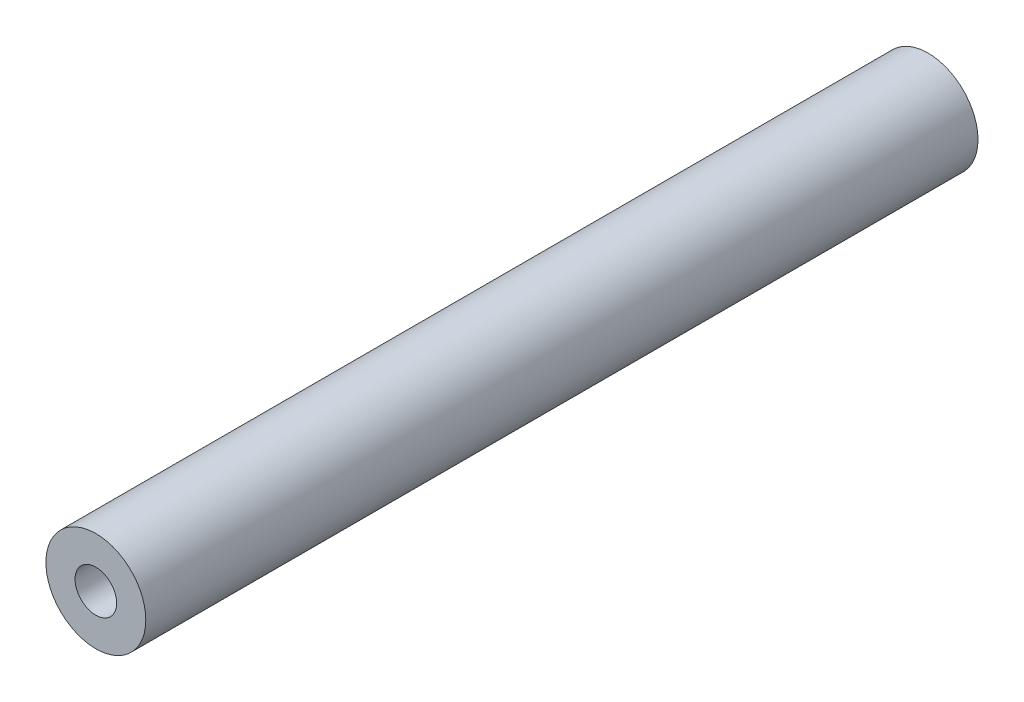
ISO-10303-21;
HEADER;
FILE_DESCRIPTION(('STEP AP214'),'2;1');
FILE_NAME('part.step','',(''),(''),'','','');
FILE_SCHEMA(('AUTOMOTIVE_DESIGN { 1 0 10303 214 1 1 1 1 }'));
ENDSEC;
DATA;
#1=APPLICATION_CONTEXT('core data for automotive mechanical design processes');
#2=APPLICATION_PROTOCOL_DEFINITION('international standard','automotive_design',2000,#1);
#3=PRODUCT_CONTEXT('',#1,'mechanical');
#4=PRODUCT('Part','Part','',(#3));
#5=PRODUCT_RELATED_PRODUCT_CATEGORY('part','',(#4));
#6=PRODUCT_DEFINITION_FORMATION('','',#4);
#7=PRODUCT_DEFINITION_CONTEXT('part definition',#1,'design');
#8=PRODUCT_DEFINITION('design','',#6,#7);
#9=PRODUCT_DEFINITION_SHAPE('','',#8);
#10=(LENGTH_UNIT() NAMED_UNIT(*) SI_UNIT(.MILLI.,.METRE.));
#11=(NAMED_UNIT(*) PLANE_ANGLE_UNIT() SI_UNIT($,.RADIAN.));
#12=(NAMED_UNIT(*) SI_UNIT($,.STERADIAN.) SOLID_ANGLE_UNIT());
#13=UNCERTAINTY_MEASURE_WITH_UNIT(LENGTH_MEASURE(1.E-05),#10,'distance_accuracy_value','');
#14=(GEOMETRIC_REPRESENTATION_CONTEXT(3) GLOBAL_UNCERTAINTY_ASSIGNED_CONTEXT((#13)) GLOBAL_UNIT_ASSIGNED_CONTEXT((#10,
#11,#12)) REPRESENTATION_CONTEXT('',''));
#15=CARTESIAN_POINT('',(0.,0.,0.));
#16=DIRECTION('',(0.,0.,1.));
#17=DIRECTION('',(1.,0.,0.));
#18=AXIS2_PLACEMENT_3D('',#15,#16,#17);
#19=CARTESIAN_POINT('',(0.,0.,100.));
#20=DIRECTION('',(0.,0.,-1.));
#21=DIRECTION('',(-1.,0.,0.));
#22=AXIS2_PLACEMENT_3D('',#19,#20,#21);
#23=CYLINDRICAL_SURFACE('',#22,6.);
#24=CARTESIAN_POINT('',(0.,0.,100.));
#25=DIRECTION('',(0.,0.,1.));
#26=DIRECTION('',(1.,0.,0.));
#27=AXIS2_PLACEMENT_3D('',#24,#25,#26);
#28=CIRCLE('',#27,6.);
#29=CARTESIAN_POINT('',(6.,0.,100.));
#30=VERTEX_POINT('',#29);
#31=EDGE_CURVE('E11',#30,#30,#28,.T.);
#32=ORIENTED_EDGE('',*,*,#31,.F.);
#33=EDGE_LOOP('',(#32));
#34=FACE_BOUND('',#33,.T.);
#35=CARTESIAN_POINT('',(0.,0.,0.));
#36=DIRECTION('',(0.,0.,1.));
#37=DIRECTION('',(1.,0.,0.));
#38=AXIS2_PLACEMENT_3D('',#35,#36,#37);
#39=CIRCLE('',#38,6.);
#40=CARTESIAN_POINT('',(6.,0.,0.));
#41=VERTEX_POINT('',#40);
#42=EDGE_CURVE('E42',#41,#41,#39,.T.);
#43=ORIENTED_EDGE('',*,*,#42,.T.);
#44=EDGE_LOOP('',(#43));
#45=FACE_BOUND('',#44,.T.);
#46=ADVANCED_FACE('F39',(#34,#45),#23,.T.);
#47=CARTESIAN_POINT('',(0.,0.,100.));
#48=DIRECTION('',(0.,0.,1.));
#49=DIRECTION('',(1.,0.,0.));
#50=AXIS2_PLACEMENT_3D('',#47,#48,#49);
#51=PLANE('',#50);
#52=CARTESIAN_POINT('',(0.,0.,100.));
#53=DIRECTION('',(0.,0.,1.));
#54=DIRECTION('',(1.,0.,0.));
#55=AXIS2_PLACEMENT_3D('',#52,#53,#54);
#56=CIRCLE('',#55,2.49999999999999);
#57=CARTESIAN_POINT('',(2.49999999999999,0.,100.));
#58=VERTEX_POINT('',#57);
#59=EDGE_CURVE('E63',#58,#58,#56,.T.);
#60=ORIENTED_EDGE('',*,*,#59,.F.);
#61=EDGE_LOOP('',(#60));
#62=FACE_BOUND('',#61,.T.);
#63=ORIENTED_EDGE('',*,*,#31,.T.);
#64=EDGE_LOOP('',(#63));
#65=FACE_BOUND('',#64,.T.);
#66=ADVANCED_FACE('F81',(#62,#65),#51,.T.);
#67=CARTESIAN_POINT('',(0.,0.,0.));
#68=DIRECTION('',(0.,0.,1.));
#69=DIRECTION('',(1.,0.,0.));
#70=AXIS2_PLACEMENT_3D('',#67,#68,#69);
#71=PLANE('',#70);
#72=CARTESIAN_POINT('',(0.,0.,0.));
#73=DIRECTION('',(0.,0.,-1.));
#74=DIRECTION('',(-1.,0.,0.));
#75=AXIS2_PLACEMENT_3D('',#72,#73,#74);
#76=CIRCLE('',#75,2.5);
#77=CARTESIAN_POINT('',(-2.5,0.,0.));
#78=VERTEX_POINT('',#77);
#79=EDGE_CURVE('E62',#78,#78,#76,.T.);
#80=ORIENTED_EDGE('',*,*,#79,.F.);
#81=EDGE_LOOP('',(#80));
#82=FACE_BOUND('',#81,.T.);
#83=ORIENTED_EDGE('',*,*,#42,.F.);
#84=EDGE_LOOP('',(#83));
#85=FACE_BOUND('',#84,.T.);
#86=ADVANCED_FACE('F78',(#82,#85),#71,.F.);
#87=CARTESIAN_POINT('',(0.,0.,15.));
#88=DIRECTION('',(0.,0.,-1.));
#89=DIRECTION('',(-1.,0.,0.));
#90=AXIS2_PLACEMENT_3D('',#87,#88,#89);
#91=CONICAL_SURFACE('',#90,2.5,1.02974425867665);
#92=CARTESIAN_POINT('',(0.,0.,16.5021515475689));
#93=VERTEX_POINT('',#92);
#94=VERTEX_LOOP('',#93);
#95=FACE_BOUND('',#94,.T.);
#96=CARTESIAN_POINT('',(0.,0.,15.));
#97=DIRECTION('',(0.,0.,-1.));
#98=DIRECTION('',(-1.,0.,0.));
#99=AXIS2_PLACEMENT_3D('',#96,#97,#98);
#100=CIRCLE('',#99,2.5);
#101=CARTESIAN_POINT('',(-2.5,0.,15.));
#102=VERTEX_POINT('',#101);
#103=EDGE_CURVE('E66',#102,#102,#100,.T.);
#104=ORIENTED_EDGE('',*,*,#103,.T.);
#105=EDGE_LOOP('',(#104));
#106=FACE_BOUND('',#105,.T.);
#107=ADVANCED_FACE('F80',(#95,#106),#91,.F.);
#108=CARTESIAN_POINT('',(0.,0.,0.));
#109=DIRECTION('',(0.,0.,-1.));
#110=DIRECTION('',(-1.,0.,0.));
#111=AXIS2_PLACEMENT_3D('',#108,#109,#110);
#112=CYLINDRICAL_SURFACE('',#111,2.5);
#113=ORIENTED_EDGE('',*,*,#103,.F.);
#114=EDGE_LOOP('',(#113));
#115=FACE_BOUND('',#114,.T.);
#116=ORIENTED_EDGE('',*,*,#79,.T.);
#117=EDGE_LOOP('',(#116));
#118=FACE_BOUND('',#117,.T.);
#119=ADVANCED_FACE('F56',(#115,#118),#112,.F.);
#120=CARTESIAN_POINT('',(0.,0.,85.));
#121=DIRECTION('',(0.,0.,1.));
#122=DIRECTION('',(1.,0.,0.));
#123=AXIS2_PLACEMENT_3D('',#120,#121,#122);
#124=CONICAL_SURFACE('',#123,2.49999999999999,1.02974425867665);
#125=CARTESIAN_POINT('',(0.,0.,83.4978484524311));
#126=VERTEX_POINT('',#125);
#127=VERTEX_LOOP('',#126);
#128=FACE_BOUND('',#127,.T.);
#129=CARTESIAN_POINT('',(0.,0.,85.));
#130=DIRECTION('',(0.,0.,1.));
#131=DIRECTION('',(1.,0.,0.));
#132=AXIS2_PLACEMENT_3D('',#129,#130,#131);
#133=CIRCLE('',#132,2.49999999999999);
#134=CARTESIAN_POINT('',(2.49999999999999,0.,85.));
#135=VERTEX_POINT('',#134);
#136=EDGE_CURVE('E60',#135,#135,#133,.T.);
#137=ORIENTED_EDGE('',*,*,#136,.T.);
#138=EDGE_LOOP('',(#137));
#139=FACE_BOUND('',#138,.T.);
#140=ADVANCED_FACE('F52',(#128,#139),#124,.F.);
#141=CARTESIAN_POINT('',(0.,0.,100.));
#142=DIRECTION('',(0.,0.,1.));
#143=DIRECTION('',(1.,0.,0.));
#144=AXIS2_PLACEMENT_3D('',#141,#142,#143);
#145=CYLINDRICAL_SURFACE('',#144,2.49999999999999);
#146=ORIENTED_EDGE('',*,*,#136,.F.);
#147=EDGE_LOOP('',(#146));
#148=FACE_BOUND('',#147,.T.);
#149=ORIENTED_EDGE('',*,*,#59,.T.);
#150=EDGE_LOOP('',(#149));
#151=FACE_BOUND('',#150,.T.);
#152=ADVANCED_FACE('F55',(#148,#151),#145,.F.);
#153=CLOSED_SHELL('',(#46,#66,#86,#107,#119,#140,#152));
#154=MANIFOLD_SOLID_BREP('B2',#153);
#155=ADVANCED_BREP_SHAPE_REPRESENTATION('',(#18,#154),#14);
#156=SHAPE_DEFINITION_REPRESENTATION(#9,#155);
ENDSEC;
END-ISO-10303-21;
